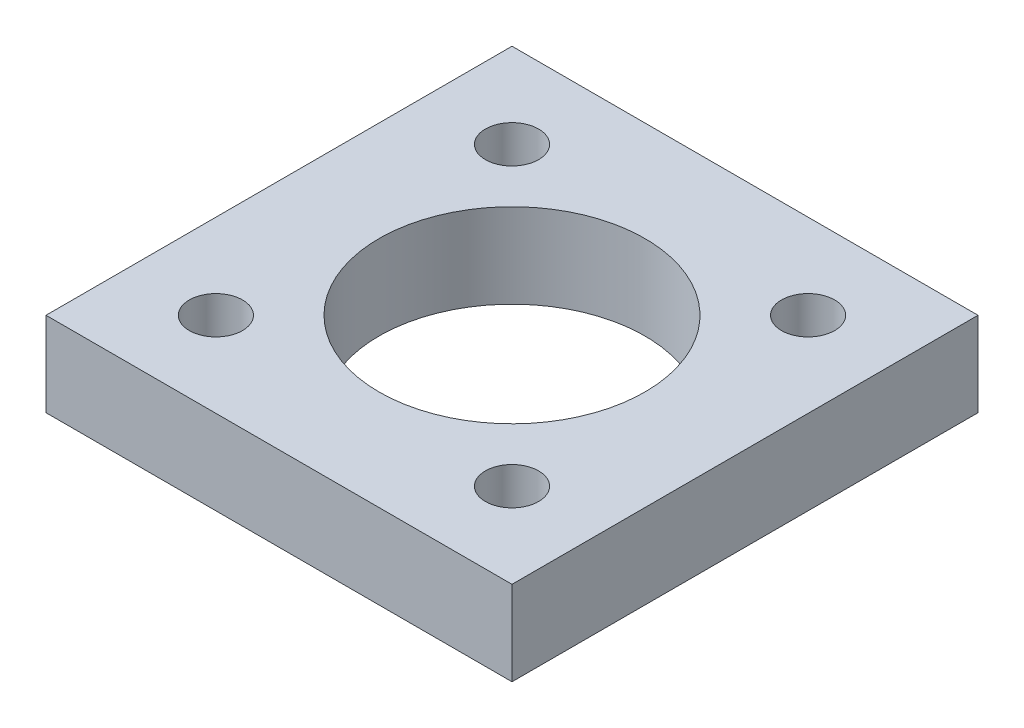
ISO-10303-21;
HEADER;
FILE_DESCRIPTION(('STEP AP214'),'2;1');
FILE_NAME('part.step','',(''),(''),'','','');
FILE_SCHEMA(('AUTOMOTIVE_DESIGN { 1 0 10303 214 1 1 1 1 }'));
ENDSEC;
DATA;
#1=APPLICATION_CONTEXT('core data for automotive mechanical design processes');
#2=APPLICATION_PROTOCOL_DEFINITION('international standard','automotive_design',2000,#1);
#3=PRODUCT_CONTEXT('',#1,'mechanical');
#4=PRODUCT('Part','Part','',(#3));
#5=PRODUCT_RELATED_PRODUCT_CATEGORY('part','',(#4));
#6=PRODUCT_DEFINITION_FORMATION('','',#4);
#7=PRODUCT_DEFINITION_CONTEXT('part definition',#1,'design');
#8=PRODUCT_DEFINITION('design','',#6,#7);
#9=PRODUCT_DEFINITION_SHAPE('','',#8);
#10=(LENGTH_UNIT() NAMED_UNIT(*) SI_UNIT(.MILLI.,.METRE.));
#11=(NAMED_UNIT(*) PLANE_ANGLE_UNIT() SI_UNIT($,.RADIAN.));
#12=(NAMED_UNIT(*) SI_UNIT($,.STERADIAN.) SOLID_ANGLE_UNIT());
#13=UNCERTAINTY_MEASURE_WITH_UNIT(LENGTH_MEASURE(1.E-05),#10,'distance_accuracy_value','');
#14=(GEOMETRIC_REPRESENTATION_CONTEXT(3) GLOBAL_UNCERTAINTY_ASSIGNED_CONTEXT((#13)) GLOBAL_UNIT_ASSIGNED_CONTEXT((#10,
#11,#12)) REPRESENTATION_CONTEXT('',''));
#15=CARTESIAN_POINT('',(0.,0.,0.));
#16=DIRECTION('',(0.,0.,1.));
#17=DIRECTION('',(1.,0.,0.));
#18=AXIS2_PLACEMENT_3D('',#15,#16,#17);
#19=CARTESIAN_POINT('',(0.,3.175,0.));
#20=DIRECTION('',(0.,1.,0.));
#21=DIRECTION('',(0.,0.,1.));
#22=AXIS2_PLACEMENT_3D('',#19,#20,#21);
#23=PLANE('',#22);
#24=CARTESIAN_POINT('',(5.56775879506288,3.175,5.56775879506287));
#25=DIRECTION('',(0.,1.,0.));
#26=DIRECTION('',(0.,0.,1.));
#27=AXIS2_PLACEMENT_3D('',#24,#25,#26);
#28=CIRCLE('',#27,0.999999999999999);
#29=CARTESIAN_POINT('',(5.56775879506288,3.175,6.56775879506287));
#30=VERTEX_POINT('',#29);
#31=EDGE_CURVE('E126',#30,#30,#28,.T.);
#32=ORIENTED_EDGE('',*,*,#31,.F.);
#33=EDGE_LOOP('',(#32));
#34=FACE_BOUND('',#33,.T.);
#35=CARTESIAN_POINT('',(0.,3.175,0.));
#36=DIRECTION('',(0.,1.,0.));
#37=DIRECTION('',(0.,0.,1.));
#38=AXIS2_PLACEMENT_3D('',#35,#36,#37);
#39=CIRCLE('',#38,5.);
#40=CARTESIAN_POINT('',(0.,3.175,5.));
#41=VERTEX_POINT('',#40);
#42=EDGE_CURVE('E114',#41,#41,#39,.T.);
#43=ORIENTED_EDGE('',*,*,#42,.F.);
#44=EDGE_LOOP('',(#43));
#45=FACE_BOUND('',#44,.T.);
#46=DIRECTION('',(0.,0.,1.));
#47=VECTOR('',#46,1.);
#48=CARTESIAN_POINT('',(-8.763,3.175,8.763));
#49=LINE('',#48,#47);
#50=CARTESIAN_POINT('',(-8.763,3.175,-8.763));
#51=VERTEX_POINT('',#50);
#52=CARTESIAN_POINT('',(-8.763,3.175,8.763));
#53=VERTEX_POINT('',#52);
#54=EDGE_CURVE('E84',#51,#53,#49,.T.);
#55=ORIENTED_EDGE('',*,*,#54,.T.);
#56=DIRECTION('',(1.,0.,0.));
#57=VECTOR('',#56,1.);
#58=CARTESIAN_POINT('',(8.763,3.175,8.763));
#59=LINE('',#58,#57);
#60=CARTESIAN_POINT('',(8.763,3.175,8.763));
#61=VERTEX_POINT('',#60);
#62=EDGE_CURVE('E79',#53,#61,#59,.T.);
#63=ORIENTED_EDGE('',*,*,#62,.T.);
#64=DIRECTION('',(0.,0.,-1.));
#65=VECTOR('',#64,1.);
#66=CARTESIAN_POINT('',(8.763,3.175,8.763));
#67=LINE('',#66,#65);
#68=CARTESIAN_POINT('',(8.763,3.175,-8.763));
#69=VERTEX_POINT('',#68);
#70=EDGE_CURVE('E82',#61,#69,#67,.T.);
#71=ORIENTED_EDGE('',*,*,#70,.T.);
#72=DIRECTION('',(-1.,0.,0.));
#73=VECTOR('',#72,1.);
#74=CARTESIAN_POINT('',(8.763,3.175,-8.763));
#75=LINE('',#74,#73);
#76=EDGE_CURVE('E49',#69,#51,#75,.T.);
#77=ORIENTED_EDGE('',*,*,#76,.T.);
#78=EDGE_LOOP('',(#55,#63,#71,#77));
#79=FACE_BOUND('',#78,.T.);
#80=CARTESIAN_POINT('',(-5.56775879506287,3.175,-5.56775879506287));
#81=DIRECTION('',(0.,1.,0.));
#82=DIRECTION('',(0.,0.,1.));
#83=AXIS2_PLACEMENT_3D('',#80,#81,#82);
#84=CIRCLE('',#83,1.);
#85=CARTESIAN_POINT('',(-5.56775879506287,3.175,-4.56775879506287));
#86=VERTEX_POINT('',#85);
#87=EDGE_CURVE('E99',#86,#86,#84,.T.);
#88=ORIENTED_EDGE('',*,*,#87,.F.);
#89=EDGE_LOOP('',(#88));
#90=FACE_BOUND('',#89,.T.);
#91=CARTESIAN_POINT('',(5.56775879506287,3.175,-5.56775879506288));
#92=DIRECTION('',(0.,1.,0.));
#93=DIRECTION('',(0.,0.,1.));
#94=AXIS2_PLACEMENT_3D('',#91,#92,#93);
#95=CIRCLE('',#94,1.);
#96=CARTESIAN_POINT('',(5.56775879506287,3.175,-4.56775879506287));
#97=VERTEX_POINT('',#96);
#98=EDGE_CURVE('E120',#97,#97,#95,.T.);
#99=ORIENTED_EDGE('',*,*,#98,.F.);
#100=EDGE_LOOP('',(#99));
#101=FACE_BOUND('',#100,.T.);
#102=CARTESIAN_POINT('',(-5.56775879506287,3.175,5.56775879506288));
#103=DIRECTION('',(0.,1.,0.));
#104=DIRECTION('',(0.,0.,1.));
#105=AXIS2_PLACEMENT_3D('',#102,#103,#104);
#106=CIRCLE('',#105,1.);
#107=CARTESIAN_POINT('',(-5.56775879506287,3.175,6.56775879506288));
#108=VERTEX_POINT('',#107);
#109=EDGE_CURVE('E132',#108,#108,#106,.T.);
#110=ORIENTED_EDGE('',*,*,#109,.F.);
#111=EDGE_LOOP('',(#110));
#112=FACE_BOUND('',#111,.T.);
#113=ADVANCED_FACE('F32',(#34,#45,#79,#90,#101,#112),#23,.T.);
#114=CARTESIAN_POINT('',(0.,0.,0.));
#115=DIRECTION('',(0.,1.,0.));
#116=DIRECTION('',(0.,0.,1.));
#117=AXIS2_PLACEMENT_3D('',#114,#115,#116);
#118=PLANE('',#117);
#119=DIRECTION('',(0.,0.,1.));
#120=VECTOR('',#119,1.);
#121=CARTESIAN_POINT('',(-8.763,0.,8.763));
#122=LINE('',#121,#120);
#123=CARTESIAN_POINT('',(-8.763,0.,-8.763));
#124=VERTEX_POINT('',#123);
#125=CARTESIAN_POINT('',(-8.763,0.,8.763));
#126=VERTEX_POINT('',#125);
#127=EDGE_CURVE('E96',#124,#126,#122,.T.);
#128=ORIENTED_EDGE('',*,*,#127,.F.);
#129=DIRECTION('',(-1.,0.,0.));
#130=VECTOR('',#129,1.);
#131=CARTESIAN_POINT('',(8.763,0.,-8.763));
#132=LINE('',#131,#130);
#133=CARTESIAN_POINT('',(8.763,0.,-8.763));
#134=VERTEX_POINT('',#133);
#135=EDGE_CURVE('E72',#134,#124,#132,.T.);
#136=ORIENTED_EDGE('',*,*,#135,.F.);
#137=DIRECTION('',(0.,0.,-1.));
#138=VECTOR('',#137,1.);
#139=CARTESIAN_POINT('',(8.763,0.,8.763));
#140=LINE('',#139,#138);
#141=CARTESIAN_POINT('',(8.763,0.,8.763));
#142=VERTEX_POINT('',#141);
#143=EDGE_CURVE('E66',#142,#134,#140,.T.);
#144=ORIENTED_EDGE('',*,*,#143,.F.);
#145=DIRECTION('',(1.,0.,0.));
#146=VECTOR('',#145,1.);
#147=CARTESIAN_POINT('',(8.763,0.,8.763));
#148=LINE('',#147,#146);
#149=EDGE_CURVE('E88',#126,#142,#148,.T.);
#150=ORIENTED_EDGE('',*,*,#149,.F.);
#151=EDGE_LOOP('',(#128,#136,#144,#150));
#152=FACE_BOUND('',#151,.T.);
#153=CARTESIAN_POINT('',(-5.56775879506287,0.,-5.56775879506287));
#154=DIRECTION('',(0.,1.,0.));
#155=DIRECTION('',(0.,0.,1.));
#156=AXIS2_PLACEMENT_3D('',#153,#154,#155);
#157=CIRCLE('',#156,1.);
#158=CARTESIAN_POINT('',(-5.56775879506287,0.,-4.56775879506287));
#159=VERTEX_POINT('',#158);
#160=EDGE_CURVE('E111',#159,#159,#157,.T.);
#161=ORIENTED_EDGE('',*,*,#160,.T.);
#162=EDGE_LOOP('',(#161));
#163=FACE_BOUND('',#162,.T.);
#164=CARTESIAN_POINT('',(0.,0.,0.));
#165=DIRECTION('',(0.,1.,0.));
#166=DIRECTION('',(0.,0.,1.));
#167=AXIS2_PLACEMENT_3D('',#164,#165,#166);
#168=CIRCLE('',#167,5.);
#169=CARTESIAN_POINT('',(0.,0.,5.));
#170=VERTEX_POINT('',#169);
#171=EDGE_CURVE('E117',#170,#170,#168,.T.);
#172=ORIENTED_EDGE('',*,*,#171,.T.);
#173=EDGE_LOOP('',(#172));
#174=FACE_BOUND('',#173,.T.);
#175=CARTESIAN_POINT('',(5.56775879506287,0.,-5.56775879506288));
#176=DIRECTION('',(0.,1.,0.));
#177=DIRECTION('',(0.,0.,1.));
#178=AXIS2_PLACEMENT_3D('',#175,#176,#177);
#179=CIRCLE('',#178,1.);
#180=CARTESIAN_POINT('',(5.56775879506287,0.,-4.56775879506287));
#181=VERTEX_POINT('',#180);
#182=EDGE_CURVE('E123',#181,#181,#179,.T.);
#183=ORIENTED_EDGE('',*,*,#182,.T.);
#184=EDGE_LOOP('',(#183));
#185=FACE_BOUND('',#184,.T.);
#186=CARTESIAN_POINT('',(5.56775879506288,0.,5.56775879506287));
#187=DIRECTION('',(0.,1.,0.));
#188=DIRECTION('',(0.,0.,1.));
#189=AXIS2_PLACEMENT_3D('',#186,#187,#188);
#190=CIRCLE('',#189,0.999999999999999);
#191=CARTESIAN_POINT('',(5.56775879506288,0.,6.56775879506287));
#192=VERTEX_POINT('',#191);
#193=EDGE_CURVE('E129',#192,#192,#190,.T.);
#194=ORIENTED_EDGE('',*,*,#193,.T.);
#195=EDGE_LOOP('',(#194));
#196=FACE_BOUND('',#195,.T.);
#197=CARTESIAN_POINT('',(-5.56775879506287,0.,5.56775879506288));
#198=DIRECTION('',(0.,1.,0.));
#199=DIRECTION('',(0.,0.,1.));
#200=AXIS2_PLACEMENT_3D('',#197,#198,#199);
#201=CIRCLE('',#200,1.);
#202=CARTESIAN_POINT('',(-5.56775879506287,0.,6.56775879506288));
#203=VERTEX_POINT('',#202);
#204=EDGE_CURVE('E135',#203,#203,#201,.T.);
#205=ORIENTED_EDGE('',*,*,#204,.T.);
#206=EDGE_LOOP('',(#205));
#207=FACE_BOUND('',#206,.T.);
#208=ADVANCED_FACE('F107',(#152,#163,#174,#185,#196,#207),#118,.F.);
#209=CARTESIAN_POINT('',(-8.763,3.175,8.763));
#210=DIRECTION('',(1.,0.,0.));
#211=DIRECTION('',(0.,0.,-1.));
#212=AXIS2_PLACEMENT_3D('',#209,#210,#211);
#213=PLANE('',#212);
#214=ORIENTED_EDGE('',*,*,#127,.T.);
#215=DIRECTION('',(0.,-1.,0.));
#216=VECTOR('',#215,1.);
#217=CARTESIAN_POINT('',(-8.763,3.175,8.763));
#218=LINE('',#217,#216);
#219=EDGE_CURVE('E11',#53,#126,#218,.T.);
#220=ORIENTED_EDGE('',*,*,#219,.F.);
#221=ORIENTED_EDGE('',*,*,#54,.F.);
#222=DIRECTION('',(0.,-1.,0.));
#223=VECTOR('',#222,1.);
#224=CARTESIAN_POINT('',(-8.763,3.175,-8.763));
#225=LINE('',#224,#223);
#226=EDGE_CURVE('E92',#51,#124,#225,.T.);
#227=ORIENTED_EDGE('',*,*,#226,.T.);
#228=EDGE_LOOP('',(#214,#220,#221,#227));
#229=FACE_BOUND('',#228,.T.);
#230=ADVANCED_FACE('F34',(#229),#213,.F.);
#231=CARTESIAN_POINT('',(8.763,3.175,8.763));
#232=DIRECTION('',(0.,0.,-1.));
#233=DIRECTION('',(-1.,0.,0.));
#234=AXIS2_PLACEMENT_3D('',#231,#232,#233);
#235=PLANE('',#234);
#236=ORIENTED_EDGE('',*,*,#149,.T.);
#237=DIRECTION('',(0.,-1.,0.));
#238=VECTOR('',#237,1.);
#239=CARTESIAN_POINT('',(8.763,3.175,8.763));
#240=LINE('',#239,#238);
#241=EDGE_CURVE('E41',#61,#142,#240,.T.);
#242=ORIENTED_EDGE('',*,*,#241,.F.);
#243=ORIENTED_EDGE('',*,*,#62,.F.);
#244=ORIENTED_EDGE('',*,*,#219,.T.);
#245=EDGE_LOOP('',(#236,#242,#243,#244));
#246=FACE_BOUND('',#245,.T.);
#247=ADVANCED_FACE('F87',(#246),#235,.F.);
#248=CARTESIAN_POINT('',(8.763,3.175,8.763));
#249=DIRECTION('',(-1.,0.,0.));
#250=DIRECTION('',(0.,0.,1.));
#251=AXIS2_PLACEMENT_3D('',#248,#249,#250);
#252=PLANE('',#251);
#253=ORIENTED_EDGE('',*,*,#143,.T.);
#254=DIRECTION('',(0.,-1.,0.));
#255=VECTOR('',#254,1.);
#256=CARTESIAN_POINT('',(8.763,3.175,-8.763));
#257=LINE('',#256,#255);
#258=EDGE_CURVE('E89',#69,#134,#257,.T.);
#259=ORIENTED_EDGE('',*,*,#258,.F.);
#260=ORIENTED_EDGE('',*,*,#70,.F.);
#261=ORIENTED_EDGE('',*,*,#241,.T.);
#262=EDGE_LOOP('',(#253,#259,#260,#261));
#263=FACE_BOUND('',#262,.T.);
#264=ADVANCED_FACE('F90',(#263),#252,.F.);
#265=CARTESIAN_POINT('',(8.763,3.175,-8.763));
#266=DIRECTION('',(0.,0.,1.));
#267=DIRECTION('',(1.,0.,0.));
#268=AXIS2_PLACEMENT_3D('',#265,#266,#267);
#269=PLANE('',#268);
#270=ORIENTED_EDGE('',*,*,#135,.T.);
#271=ORIENTED_EDGE('',*,*,#226,.F.);
#272=ORIENTED_EDGE('',*,*,#76,.F.);
#273=ORIENTED_EDGE('',*,*,#258,.T.);
#274=EDGE_LOOP('',(#270,#271,#272,#273));
#275=FACE_BOUND('',#274,.T.);
#276=ADVANCED_FACE('F104',(#275),#269,.F.);
#277=CARTESIAN_POINT('',(-5.56775879506287,3.175,-5.56775879506287));
#278=DIRECTION('',(0.,-1.,0.));
#279=DIRECTION('',(0.,0.,-1.));
#280=AXIS2_PLACEMENT_3D('',#277,#278,#279);
#281=CYLINDRICAL_SURFACE('',#280,1.);
#282=ORIENTED_EDGE('',*,*,#87,.T.);
#283=EDGE_LOOP('',(#282));
#284=FACE_BOUND('',#283,.T.);
#285=ORIENTED_EDGE('',*,*,#160,.F.);
#286=EDGE_LOOP('',(#285));
#287=FACE_BOUND('',#286,.T.);
#288=ADVANCED_FACE('F154',(#284,#287),#281,.F.);
#289=CARTESIAN_POINT('',(0.,3.175,0.));
#290=DIRECTION('',(0.,-1.,0.));
#291=DIRECTION('',(0.,0.,-1.));
#292=AXIS2_PLACEMENT_3D('',#289,#290,#291);
#293=CYLINDRICAL_SURFACE('',#292,5.);
#294=ORIENTED_EDGE('',*,*,#42,.T.);
#295=EDGE_LOOP('',(#294));
#296=FACE_BOUND('',#295,.T.);
#297=ORIENTED_EDGE('',*,*,#171,.F.);
#298=EDGE_LOOP('',(#297));
#299=FACE_BOUND('',#298,.T.);
#300=ADVANCED_FACE('F200',(#296,#299),#293,.F.);
#301=CARTESIAN_POINT('',(5.56775879506287,3.175,-5.56775879506288));
#302=DIRECTION('',(0.,-1.,0.));
#303=DIRECTION('',(0.,0.,-1.));
#304=AXIS2_PLACEMENT_3D('',#301,#302,#303);
#305=CYLINDRICAL_SURFACE('',#304,1.);
#306=ORIENTED_EDGE('',*,*,#98,.T.);
#307=EDGE_LOOP('',(#306));
#308=FACE_BOUND('',#307,.T.);
#309=ORIENTED_EDGE('',*,*,#182,.F.);
#310=EDGE_LOOP('',(#309));
#311=FACE_BOUND('',#310,.T.);
#312=ADVANCED_FACE('F208',(#308,#311),#305,.F.);
#313=CARTESIAN_POINT('',(5.56775879506288,3.175,5.56775879506287));
#314=DIRECTION('',(0.,-1.,0.));
#315=DIRECTION('',(0.,0.,-1.));
#316=AXIS2_PLACEMENT_3D('',#313,#314,#315);
#317=CYLINDRICAL_SURFACE('',#316,0.999999999999999);
#318=ORIENTED_EDGE('',*,*,#31,.T.);
#319=EDGE_LOOP('',(#318));
#320=FACE_BOUND('',#319,.T.);
#321=ORIENTED_EDGE('',*,*,#193,.F.);
#322=EDGE_LOOP('',(#321));
#323=FACE_BOUND('',#322,.T.);
#324=ADVANCED_FACE('F216',(#320,#323),#317,.F.);
#325=CARTESIAN_POINT('',(-5.56775879506287,3.175,5.56775879506288));
#326=DIRECTION('',(0.,-1.,0.));
#327=DIRECTION('',(0.,0.,-1.));
#328=AXIS2_PLACEMENT_3D('',#325,#326,#327);
#329=CYLINDRICAL_SURFACE('',#328,1.);
#330=ORIENTED_EDGE('',*,*,#109,.T.);
#331=EDGE_LOOP('',(#330));
#332=FACE_BOUND('',#331,.T.);
#333=ORIENTED_EDGE('',*,*,#204,.F.);
#334=EDGE_LOOP('',(#333));
#335=FACE_BOUND('',#334,.T.);
#336=ADVANCED_FACE('F141',(#332,#335),#329,.F.);
#337=CLOSED_SHELL('',(#113,#208,#230,#247,#264,#276,#288,#300,#312,#324,#336));
#338=MANIFOLD_SOLID_BREP('B2',#337);
#339=ADVANCED_BREP_SHAPE_REPRESENTATION('',(#18,#338),#14);
#340=SHAPE_DEFINITION_REPRESENTATION(#9,#339);
ENDSEC;
END-ISO-10303-21;
